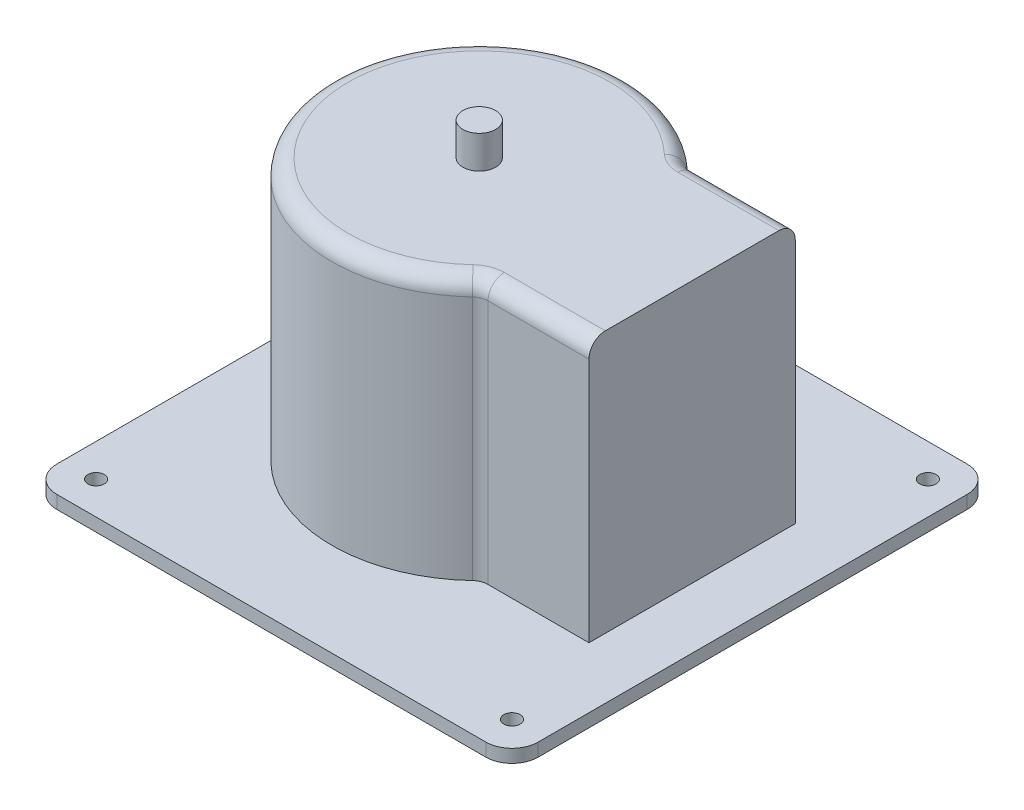
ISO-10303-21;
HEADER;
FILE_DESCRIPTION(('STEP AP214'),'2;1');
FILE_NAME('part.step','',(''),(''),'','','');
FILE_SCHEMA(('AUTOMOTIVE_DESIGN { 1 0 10303 214 1 1 1 1 }'));
ENDSEC;
DATA;
#1=APPLICATION_CONTEXT('core data for automotive mechanical design processes');
#2=APPLICATION_PROTOCOL_DEFINITION('international standard','automotive_design',2000,#1);
#3=PRODUCT_CONTEXT('',#1,'mechanical');
#4=PRODUCT('Part','Part','',(#3));
#5=PRODUCT_RELATED_PRODUCT_CATEGORY('part','',(#4));
#6=PRODUCT_DEFINITION_FORMATION('','',#4);
#7=PRODUCT_DEFINITION_CONTEXT('part definition',#1,'design');
#8=PRODUCT_DEFINITION('design','',#6,#7);
#9=PRODUCT_DEFINITION_SHAPE('','',#8);
#10=(LENGTH_UNIT() NAMED_UNIT(*) SI_UNIT(.MILLI.,.METRE.));
#11=(NAMED_UNIT(*) PLANE_ANGLE_UNIT() SI_UNIT($,.RADIAN.));
#12=(NAMED_UNIT(*) SI_UNIT($,.STERADIAN.) SOLID_ANGLE_UNIT());
#13=UNCERTAINTY_MEASURE_WITH_UNIT(LENGTH_MEASURE(1.E-05),#10,'distance_accuracy_value','');
#14=(GEOMETRIC_REPRESENTATION_CONTEXT(3) GLOBAL_UNCERTAINTY_ASSIGNED_CONTEXT((#13)) GLOBAL_UNIT_ASSIGNED_CONTEXT((#10,
#11,#12)) REPRESENTATION_CONTEXT('',''));
#15=CARTESIAN_POINT('',(0.,0.,0.));
#16=DIRECTION('',(0.,0.,1.));
#17=DIRECTION('',(1.,0.,0.));
#18=AXIS2_PLACEMENT_3D('',#15,#16,#17);
#19=CARTESIAN_POINT('',(0.,80.,0.));
#20=DIRECTION('',(0.,-1.,0.));
#21=DIRECTION('',(0.,0.,-1.));
#22=AXIS2_PLACEMENT_3D('',#19,#20,#21);
#23=CYLINDRICAL_SURFACE('',#22,45.);
#24=CARTESIAN_POINT('',(0.,0.,0.));
#25=DIRECTION('',(0.,1.,0.));
#26=DIRECTION('',(0.,0.,1.));
#27=AXIS2_PLACEMENT_3D('',#24,#25,#26);
#28=CIRCLE('',#27,45.);
#29=CARTESIAN_POINT('',(30.7551215247152,0.,-32.85));
#30=VERTEX_POINT('',#29);
#31=CARTESIAN_POINT('',(30.7551215247152,0.,32.85));
#32=VERTEX_POINT('',#31);
#33=EDGE_CURVE('E172',#30,#32,#28,.T.);
#34=ORIENTED_EDGE('',*,*,#33,.T.);
#35=DIRECTION('',(0.,-1.,0.));
#36=VECTOR('',#35,1.);
#37=CARTESIAN_POINT('',(30.7551215247152,80.,32.85));
#38=LINE('',#37,#36);
#39=CARTESIAN_POINT('',(30.7551215247152,75.,32.85));
#40=VERTEX_POINT('',#39);
#41=EDGE_CURVE('E157',#32,#40,#38,.F.);
#42=ORIENTED_EDGE('',*,*,#41,.T.);
#43=CARTESIAN_POINT('',(0.,75.,0.));
#44=DIRECTION('',(0.,1.,0.));
#45=DIRECTION('',(0.,0.,1.));
#46=AXIS2_PLACEMENT_3D('',#43,#44,#45);
#47=CIRCLE('',#46,45.);
#48=CARTESIAN_POINT('',(30.7551215247152,75.,-32.85));
#49=VERTEX_POINT('',#48);
#50=EDGE_CURVE('E169',#40,#49,#47,.F.);
#51=ORIENTED_EDGE('',*,*,#50,.T.);
#52=DIRECTION('',(0.,-1.,0.));
#53=VECTOR('',#52,1.);
#54=CARTESIAN_POINT('',(30.7551215247152,80.,-32.85));
#55=LINE('',#54,#53);
#56=EDGE_CURVE('E174',#49,#30,#55,.T.);
#57=ORIENTED_EDGE('',*,*,#56,.T.);
#58=EDGE_LOOP('',(#34,#42,#51,#57));
#59=FACE_BOUND('',#58,.T.);
#60=ADVANCED_FACE('F37',(#59),#23,.T.);
#61=CARTESIAN_POINT('',(0.,80.,0.));
#62=DIRECTION('',(0.,1.,0.));
#63=DIRECTION('',(0.,0.,1.));
#64=AXIS2_PLACEMENT_3D('',#61,#62,#63);
#65=PLANE('',#64);
#66=CARTESIAN_POINT('',(0.,80.,0.));
#67=DIRECTION('',(0.,1.,0.));
#68=DIRECTION('',(0.,0.,1.));
#69=AXIS2_PLACEMENT_3D('',#66,#67,#68);
#70=CIRCLE('',#69,5.);
#71=CARTESIAN_POINT('',(0.,80.,5.));
#72=VERTEX_POINT('',#71);
#73=EDGE_CURVE('E267',#72,#72,#70,.T.);
#74=ORIENTED_EDGE('',*,*,#73,.F.);
#75=EDGE_LOOP('',(#74));
#76=FACE_BOUND('',#75,.T.);
#77=DIRECTION('',(0.,0.,1.));
#78=VECTOR('',#77,1.);
#79=CARTESIAN_POINT('',(65.,80.,31.5));
#80=LINE('',#79,#78);
#81=CARTESIAN_POINT('',(65.,80.,-26.5));
#82=VERTEX_POINT('',#81);
#83=CARTESIAN_POINT('',(65.,80.,26.5));
#84=VERTEX_POINT('',#83);
#85=EDGE_CURVE('E271',#82,#84,#80,.T.);
#86=ORIENTED_EDGE('',*,*,#85,.F.);
#87=DIRECTION('',(1.,0.,0.));
#88=VECTOR('',#87,1.);
#89=CARTESIAN_POINT('',(0.,80.,-26.5));
#90=LINE('',#89,#88);
#91=CARTESIAN_POINT('',(34.1723572496835,80.,-26.5));
#92=VERTEX_POINT('',#91);
#93=EDGE_CURVE('E295',#82,#92,#90,.F.);
#94=ORIENTED_EDGE('',*,*,#93,.T.);
#95=CARTESIAN_POINT('',(34.1723572496835,80.,-36.5));
#96=DIRECTION('',(0.,1.,0.));
#97=DIRECTION('',(0.,0.,1.));
#98=AXIS2_PLACEMENT_3D('',#95,#96,#97);
#99=CIRCLE('',#98,10.);
#100=CARTESIAN_POINT('',(27.3378857997468,80.,-29.2));
#101=VERTEX_POINT('',#100);
#102=EDGE_CURVE('E292',#101,#92,#99,.T.);
#103=ORIENTED_EDGE('',*,*,#102,.F.);
#104=CARTESIAN_POINT('',(0.,80.,0.));
#105=DIRECTION('',(0.,1.,0.));
#106=DIRECTION('',(0.,0.,1.));
#107=AXIS2_PLACEMENT_3D('',#104,#105,#106);
#108=CIRCLE('',#107,40.);
#109=CARTESIAN_POINT('',(27.3378857997468,80.,29.2));
#110=VERTEX_POINT('',#109);
#111=EDGE_CURVE('E289',#101,#110,#108,.T.);
#112=ORIENTED_EDGE('',*,*,#111,.T.);
#113=CARTESIAN_POINT('',(34.1723572496835,80.,36.5));
#114=DIRECTION('',(0.,1.,0.));
#115=DIRECTION('',(0.,0.,1.));
#116=AXIS2_PLACEMENT_3D('',#113,#114,#115);
#117=CIRCLE('',#116,10.);
#118=CARTESIAN_POINT('',(34.1723572496835,80.,26.5));
#119=VERTEX_POINT('',#118);
#120=EDGE_CURVE('E286',#119,#110,#117,.T.);
#121=ORIENTED_EDGE('',*,*,#120,.F.);
#122=DIRECTION('',(1.,0.,0.));
#123=VECTOR('',#122,1.);
#124=CARTESIAN_POINT('',(0.,80.,26.5));
#125=LINE('',#124,#123);
#126=EDGE_CURVE('E178',#119,#84,#125,.T.);
#127=ORIENTED_EDGE('',*,*,#126,.T.);
#128=EDGE_LOOP('',(#86,#94,#103,#112,#121,#127));
#129=FACE_BOUND('',#128,.T.);
#130=ADVANCED_FACE('F339',(#76,#129),#65,.T.);
#131=CARTESIAN_POINT('',(65.,0.,0.));
#132=DIRECTION('',(1.,0.,0.));
#133=DIRECTION('',(0.,0.,-1.));
#134=AXIS2_PLACEMENT_3D('',#131,#132,#133);
#135=PLANE('',#134);
#136=DIRECTION('',(0.,1.,0.));
#137=VECTOR('',#136,1.);
#138=CARTESIAN_POINT('',(65.,80.,-31.5));
#139=LINE('',#138,#137);
#140=CARTESIAN_POINT('',(65.,0.,-31.5));
#141=VERTEX_POINT('',#140);
#142=CARTESIAN_POINT('',(65.,75.,-31.5));
#143=VERTEX_POINT('',#142);
#144=EDGE_CURVE('E275',#141,#143,#139,.T.);
#145=ORIENTED_EDGE('',*,*,#144,.T.);
#146=CARTESIAN_POINT('',(65.,75.,-26.5));
#147=DIRECTION('',(1.,0.,0.));
#148=DIRECTION('',(0.,0.,-1.));
#149=AXIS2_PLACEMENT_3D('',#146,#147,#148);
#150=CIRCLE('',#149,5.);
#151=EDGE_CURVE('E186',#143,#82,#150,.T.);
#152=ORIENTED_EDGE('',*,*,#151,.T.);
#153=ORIENTED_EDGE('',*,*,#85,.T.);
#154=CARTESIAN_POINT('',(65.,75.,26.5));
#155=DIRECTION('',(1.,0.,0.));
#156=DIRECTION('',(0.,0.,-1.));
#157=AXIS2_PLACEMENT_3D('',#154,#155,#156);
#158=CIRCLE('',#157,5.);
#159=CARTESIAN_POINT('',(65.,75.,31.5));
#160=VERTEX_POINT('',#159);
#161=EDGE_CURVE('E190',#84,#160,#158,.T.);
#162=ORIENTED_EDGE('',*,*,#161,.T.);
#163=DIRECTION('',(0.,-1.,0.));
#164=VECTOR('',#163,1.);
#165=CARTESIAN_POINT('',(65.,80.,31.5));
#166=LINE('',#165,#164);
#167=CARTESIAN_POINT('',(65.,0.,31.5));
#168=VERTEX_POINT('',#167);
#169=EDGE_CURVE('E210',#160,#168,#166,.T.);
#170=ORIENTED_EDGE('',*,*,#169,.T.);
#171=DIRECTION('',(0.,0.,-1.));
#172=VECTOR('',#171,1.);
#173=CARTESIAN_POINT('',(65.,0.,31.5));
#174=LINE('',#173,#172);
#175=EDGE_CURVE('E278',#168,#141,#174,.T.);
#176=ORIENTED_EDGE('',*,*,#175,.T.);
#177=EDGE_LOOP('',(#145,#152,#153,#162,#170,#176));
#178=FACE_BOUND('',#177,.T.);
#179=ADVANCED_FACE('F308',(#178),#135,.T.);
#180=CARTESIAN_POINT('',(-45.001,80.,-31.5));
#181=DIRECTION('',(0.,0.,-1.));
#182=DIRECTION('',(0.,1.,0.));
#183=AXIS2_PLACEMENT_3D('',#180,#181,#182);
#184=PLANE('',#183);
#185=DIRECTION('',(1.,0.,0.));
#186=VECTOR('',#185,1.);
#187=CARTESIAN_POINT('',(-45.001,0.,-31.5));
#188=LINE('',#187,#186);
#189=CARTESIAN_POINT('',(34.1723572496835,0.,-31.5));
#190=VERTEX_POINT('',#189);
#191=EDGE_CURVE('E274',#190,#141,#188,.T.);
#192=ORIENTED_EDGE('',*,*,#191,.F.);
#193=DIRECTION('',(0.,-1.,0.));
#194=VECTOR('',#193,1.);
#195=CARTESIAN_POINT('',(34.1723572496835,80.,-31.5));
#196=LINE('',#195,#194);
#197=CARTESIAN_POINT('',(34.1723572496835,75.,-31.5));
#198=VERTEX_POINT('',#197);
#199=EDGE_CURVE('E304',#190,#198,#196,.F.);
#200=ORIENTED_EDGE('',*,*,#199,.T.);
#201=DIRECTION('',(1.,0.,0.));
#202=VECTOR('',#201,1.);
#203=CARTESIAN_POINT('',(-45.001,75.,-31.5));
#204=LINE('',#203,#202);
#205=EDGE_CURVE('E302',#198,#143,#204,.T.);
#206=ORIENTED_EDGE('',*,*,#205,.T.);
#207=ORIENTED_EDGE('',*,*,#144,.F.);
#208=EDGE_LOOP('',(#192,#200,#206,#207));
#209=FACE_BOUND('',#208,.T.);
#210=ADVANCED_FACE('F337',(#209),#184,.T.);
#211=CARTESIAN_POINT('',(-45.001,80.,31.5));
#212=DIRECTION('',(0.,0.,1.));
#213=DIRECTION('',(0.,-1.,0.));
#214=AXIS2_PLACEMENT_3D('',#211,#212,#213);
#215=PLANE('',#214);
#216=DIRECTION('',(1.,0.,0.));
#217=VECTOR('',#216,1.);
#218=CARTESIAN_POINT('',(-45.001,75.,31.5));
#219=LINE('',#218,#217);
#220=CARTESIAN_POINT('',(34.1723572496835,75.,31.5));
#221=VERTEX_POINT('',#220);
#222=EDGE_CURVE('E168',#160,#221,#219,.F.);
#223=ORIENTED_EDGE('',*,*,#222,.T.);
#224=DIRECTION('',(0.,-1.,0.));
#225=VECTOR('',#224,1.);
#226=CARTESIAN_POINT('',(34.1723572496835,80.,31.5));
#227=LINE('',#226,#225);
#228=CARTESIAN_POINT('',(34.1723572496835,0.,31.5));
#229=VERTEX_POINT('',#228);
#230=EDGE_CURVE('E300',#221,#229,#227,.T.);
#231=ORIENTED_EDGE('',*,*,#230,.T.);
#232=DIRECTION('',(1.,0.,0.));
#233=VECTOR('',#232,1.);
#234=CARTESIAN_POINT('',(-45.001,0.,31.5));
#235=LINE('',#234,#233);
#236=EDGE_CURVE('E179',#229,#168,#235,.T.);
#237=ORIENTED_EDGE('',*,*,#236,.T.);
#238=ORIENTED_EDGE('',*,*,#169,.F.);
#239=EDGE_LOOP('',(#223,#231,#237,#238));
#240=FACE_BOUND('',#239,.T.);
#241=ADVANCED_FACE('F314',(#240),#215,.T.);
#242=CARTESIAN_POINT('',(34.1723572496835,80.,-36.5));
#243=DIRECTION('',(0.,-1.,0.));
#244=DIRECTION('',(0.,0.,-1.));
#245=AXIS2_PLACEMENT_3D('',#242,#243,#244);
#246=CYLINDRICAL_SURFACE('',#245,5.);
#247=CARTESIAN_POINT('',(34.1723572496835,0.,-36.5));
#248=DIRECTION('',(0.,1.,0.));
#249=DIRECTION('',(0.,0.,1.));
#250=AXIS2_PLACEMENT_3D('',#247,#248,#249);
#251=CIRCLE('',#250,5.);
#252=EDGE_CURVE('E185',#30,#190,#251,.T.);
#253=ORIENTED_EDGE('',*,*,#252,.F.);
#254=ORIENTED_EDGE('',*,*,#56,.F.);
#255=CARTESIAN_POINT('',(34.1723572496835,75.,-36.5));
#256=DIRECTION('',(0.,1.,0.));
#257=DIRECTION('',(0.,0.,1.));
#258=AXIS2_PLACEMENT_3D('',#255,#256,#257);
#259=CIRCLE('',#258,5.);
#260=EDGE_CURVE('E207',#198,#49,#259,.F.);
#261=ORIENTED_EDGE('',*,*,#260,.F.);
#262=ORIENTED_EDGE('',*,*,#199,.F.);
#263=EDGE_LOOP('',(#253,#254,#261,#262));
#264=FACE_BOUND('',#263,.T.);
#265=ADVANCED_FACE('F326',(#264),#246,.F.);
#266=CARTESIAN_POINT('',(-45.001,75.,-26.5));
#267=DIRECTION('',(1.,0.,0.));
#268=DIRECTION('',(0.,0.,-1.));
#269=AXIS2_PLACEMENT_3D('',#266,#267,#268);
#270=CYLINDRICAL_SURFACE('',#269,5.);
#271=ORIENTED_EDGE('',*,*,#151,.F.);
#272=ORIENTED_EDGE('',*,*,#205,.F.);
#273=CARTESIAN_POINT('',(34.1723572496835,75.,-26.5));
#274=DIRECTION('',(-1.,0.,0.));
#275=DIRECTION('',(0.,0.,1.));
#276=AXIS2_PLACEMENT_3D('',#273,#274,#275);
#277=CIRCLE('',#276,5.);
#278=EDGE_CURVE('E204',#92,#198,#277,.T.);
#279=ORIENTED_EDGE('',*,*,#278,.F.);
#280=ORIENTED_EDGE('',*,*,#93,.F.);
#281=EDGE_LOOP('',(#271,#272,#279,#280));
#282=FACE_BOUND('',#281,.T.);
#283=ADVANCED_FACE('F335',(#282),#270,.T.);
#284=CARTESIAN_POINT('',(0.,75.,26.5));
#285=DIRECTION('',(1.,0.,0.));
#286=DIRECTION('',(0.,0.,-1.));
#287=AXIS2_PLACEMENT_3D('',#284,#285,#286);
#288=CYLINDRICAL_SURFACE('',#287,5.);
#289=ORIENTED_EDGE('',*,*,#161,.F.);
#290=ORIENTED_EDGE('',*,*,#126,.F.);
#291=CARTESIAN_POINT('',(34.1723572496835,75.,26.5));
#292=DIRECTION('',(-1.,0.,0.));
#293=DIRECTION('',(0.,0.,1.));
#294=AXIS2_PLACEMENT_3D('',#291,#292,#293);
#295=CIRCLE('',#294,5.);
#296=EDGE_CURVE('E201',#221,#119,#295,.T.);
#297=ORIENTED_EDGE('',*,*,#296,.F.);
#298=ORIENTED_EDGE('',*,*,#222,.F.);
#299=EDGE_LOOP('',(#289,#290,#297,#298));
#300=FACE_BOUND('',#299,.T.);
#301=ADVANCED_FACE('F316',(#300),#288,.T.);
#302=CARTESIAN_POINT('',(34.1723572496835,80.,36.5));
#303=DIRECTION('',(0.,-1.,0.));
#304=DIRECTION('',(0.,0.,-1.));
#305=AXIS2_PLACEMENT_3D('',#302,#303,#304);
#306=CYLINDRICAL_SURFACE('',#305,5.);
#307=CARTESIAN_POINT('',(34.1723572496835,0.,36.5));
#308=DIRECTION('',(0.,1.,0.));
#309=DIRECTION('',(0.,0.,1.));
#310=AXIS2_PLACEMENT_3D('',#307,#308,#309);
#311=CIRCLE('',#310,5.);
#312=EDGE_CURVE('E162',#229,#32,#311,.T.);
#313=ORIENTED_EDGE('',*,*,#312,.F.);
#314=ORIENTED_EDGE('',*,*,#230,.F.);
#315=CARTESIAN_POINT('',(34.1723572496835,75.,36.5));
#316=DIRECTION('',(0.,1.,0.));
#317=DIRECTION('',(0.,0.,1.));
#318=AXIS2_PLACEMENT_3D('',#315,#316,#317);
#319=CIRCLE('',#318,5.);
#320=EDGE_CURVE('E165',#40,#221,#319,.F.);
#321=ORIENTED_EDGE('',*,*,#320,.F.);
#322=ORIENTED_EDGE('',*,*,#41,.F.);
#323=EDGE_LOOP('',(#313,#314,#321,#322));
#324=FACE_BOUND('',#323,.T.);
#325=ADVANCED_FACE('F159',(#324),#306,.F.);
#326=CARTESIAN_POINT('',(34.1723572496835,75.,-36.5));
#327=DIRECTION('',(0.,1.,0.));
#328=DIRECTION('',(0.,0.,1.));
#329=AXIS2_PLACEMENT_3D('',#326,#327,#328);
#330=TOROIDAL_SURFACE('',#329,10.,5.);
#331=ORIENTED_EDGE('',*,*,#278,.T.);
#332=ORIENTED_EDGE('',*,*,#260,.T.);
#333=CARTESIAN_POINT('',(27.3378857997468,75.,-29.2));
#334=DIRECTION('',(0.73,0.,0.683447144993671));
#335=DIRECTION('',(0.683447144993671,0.,-0.73));
#336=AXIS2_PLACEMENT_3D('',#333,#334,#335);
#337=CIRCLE('',#336,5.);
#338=EDGE_CURVE('E196',#101,#49,#337,.F.);
#339=ORIENTED_EDGE('',*,*,#338,.F.);
#340=ORIENTED_EDGE('',*,*,#102,.T.);
#341=EDGE_LOOP('',(#331,#332,#339,#340));
#342=FACE_BOUND('',#341,.T.);
#343=ADVANCED_FACE('F329',(#342),#330,.T.);
#344=CARTESIAN_POINT('',(34.1723572496835,75.,36.5));
#345=DIRECTION('',(0.,1.,0.));
#346=DIRECTION('',(0.,0.,1.));
#347=AXIS2_PLACEMENT_3D('',#344,#345,#346);
#348=TOROIDAL_SURFACE('',#347,10.,5.);
#349=ORIENTED_EDGE('',*,*,#296,.T.);
#350=ORIENTED_EDGE('',*,*,#120,.T.);
#351=CARTESIAN_POINT('',(27.3378857997468,75.,29.2));
#352=DIRECTION('',(0.73,0.,-0.683447144993671));
#353=DIRECTION('',(-0.683447144993671,0.,-0.73));
#354=AXIS2_PLACEMENT_3D('',#351,#352,#353);
#355=CIRCLE('',#354,5.);
#356=EDGE_CURVE('E194',#40,#110,#355,.F.);
#357=ORIENTED_EDGE('',*,*,#356,.F.);
#358=ORIENTED_EDGE('',*,*,#320,.T.);
#359=EDGE_LOOP('',(#349,#350,#357,#358));
#360=FACE_BOUND('',#359,.T.);
#361=ADVANCED_FACE('F319',(#360),#348,.T.);
#362=CARTESIAN_POINT('',(0.,75.,0.));
#363=DIRECTION('',(0.,1.,0.));
#364=DIRECTION('',(0.,0.,1.));
#365=AXIS2_PLACEMENT_3D('',#362,#363,#364);
#366=TOROIDAL_SURFACE('',#365,40.,5.);
#367=ORIENTED_EDGE('',*,*,#338,.T.);
#368=ORIENTED_EDGE('',*,*,#50,.F.);
#369=ORIENTED_EDGE('',*,*,#356,.T.);
#370=ORIENTED_EDGE('',*,*,#111,.F.);
#371=EDGE_LOOP('',(#367,#368,#369,#370));
#372=FACE_BOUND('',#371,.T.);
#373=ADVANCED_FACE('F322',(#372),#366,.T.);
#374=CARTESIAN_POINT('',(0.,90.,0.));
#375=DIRECTION('',(0.,-1.,0.));
#376=DIRECTION('',(0.,0.,-1.));
#377=AXIS2_PLACEMENT_3D('',#374,#375,#376);
#378=CYLINDRICAL_SURFACE('',#377,5.);
#379=CARTESIAN_POINT('',(0.,90.,0.));
#380=DIRECTION('',(0.,1.,0.));
#381=DIRECTION('',(0.,0.,1.));
#382=AXIS2_PLACEMENT_3D('',#379,#380,#381);
#383=CIRCLE('',#382,5.);
#384=CARTESIAN_POINT('',(0.,90.,5.));
#385=VERTEX_POINT('',#384);
#386=EDGE_CURVE('E197',#385,#385,#383,.T.);
#387=ORIENTED_EDGE('',*,*,#386,.F.);
#388=EDGE_LOOP('',(#387));
#389=FACE_BOUND('',#388,.T.);
#390=ORIENTED_EDGE('',*,*,#73,.T.);
#391=EDGE_LOOP('',(#390));
#392=FACE_BOUND('',#391,.T.);
#393=ADVANCED_FACE('F357',(#389,#392),#378,.T.);
#394=CARTESIAN_POINT('',(0.,90.,0.));
#395=DIRECTION('',(0.,1.,0.));
#396=DIRECTION('',(0.,0.,1.));
#397=AXIS2_PLACEMENT_3D('',#394,#395,#396);
#398=PLANE('',#397);
#399=ORIENTED_EDGE('',*,*,#386,.T.);
#400=EDGE_LOOP('',(#399));
#401=FACE_BOUND('',#400,.T.);
#402=ADVANCED_FACE('F460',(#401),#398,.T.);
#403=CARTESIAN_POINT('',(-63.5,-4.,73.5));
#404=DIRECTION('',(1.,0.,0.));
#405=DIRECTION('',(0.,0.,-1.));
#406=AXIS2_PLACEMENT_3D('',#403,#404,#405);
#407=PLANE('',#406);
#408=DIRECTION('',(0.,0.,-1.));
#409=VECTOR('',#408,1.);
#410=CARTESIAN_POINT('',(-63.5,-4.,73.5));
#411=LINE('',#410,#409);
#412=CARTESIAN_POINT('',(-63.5,-4.,65.5));
#413=VERTEX_POINT('',#412);
#414=CARTESIAN_POINT('',(-63.5,-4.,-65.5));
#415=VERTEX_POINT('',#414);
#416=EDGE_CURVE('E264',#413,#415,#411,.T.);
#417=ORIENTED_EDGE('',*,*,#416,.F.);
#418=DIRECTION('',(0.,1.,0.));
#419=VECTOR('',#418,1.);
#420=CARTESIAN_POINT('',(-63.5,-4.,65.5));
#421=LINE('',#420,#419);
#422=CARTESIAN_POINT('',(-63.5,0.,65.5));
#423=VERTEX_POINT('',#422);
#424=EDGE_CURVE('E212',#413,#423,#421,.T.);
#425=ORIENTED_EDGE('',*,*,#424,.T.);
#426=DIRECTION('',(0.,0.,-1.));
#427=VECTOR('',#426,1.);
#428=CARTESIAN_POINT('',(-63.5,0.,73.5));
#429=LINE('',#428,#427);
#430=CARTESIAN_POINT('',(-63.5,0.,-65.5));
#431=VERTEX_POINT('',#430);
#432=EDGE_CURVE('E254',#423,#431,#429,.T.);
#433=ORIENTED_EDGE('',*,*,#432,.T.);
#434=DIRECTION('',(0.,1.,0.));
#435=VECTOR('',#434,1.);
#436=CARTESIAN_POINT('',(-63.5,-4.,-65.5));
#437=LINE('',#436,#435);
#438=EDGE_CURVE('E188',#431,#415,#437,.F.);
#439=ORIENTED_EDGE('',*,*,#438,.T.);
#440=EDGE_LOOP('',(#417,#425,#433,#439));
#441=FACE_BOUND('',#440,.T.);
#442=ADVANCED_FACE('F457',(#441),#407,.F.);
#443=CARTESIAN_POINT('',(-63.5,-4.,-73.5));
#444=DIRECTION('',(0.,0.,1.));
#445=DIRECTION('',(1.,0.,0.));
#446=AXIS2_PLACEMENT_3D('',#443,#444,#445);
#447=PLANE('',#446);
#448=DIRECTION('',(1.,0.,0.));
#449=VECTOR('',#448,1.);
#450=CARTESIAN_POINT('',(-63.5,0.,-73.5));
#451=LINE('',#450,#449);
#452=CARTESIAN_POINT('',(-55.5,0.,-73.5));
#453=VERTEX_POINT('',#452);
#454=CARTESIAN_POINT('',(75.5,0.,-73.5));
#455=VERTEX_POINT('',#454);
#456=EDGE_CURVE('E245',#453,#455,#451,.T.);
#457=ORIENTED_EDGE('',*,*,#456,.T.);
#458=DIRECTION('',(0.,1.,0.));
#459=VECTOR('',#458,1.);
#460=CARTESIAN_POINT('',(75.5,-4.,-73.5));
#461=LINE('',#460,#459);
#462=CARTESIAN_POINT('',(75.5,-4.,-73.5));
#463=VERTEX_POINT('',#462);
#464=EDGE_CURVE('E11',#455,#463,#461,.F.);
#465=ORIENTED_EDGE('',*,*,#464,.T.);
#466=DIRECTION('',(1.,0.,0.));
#467=VECTOR('',#466,1.);
#468=CARTESIAN_POINT('',(-63.5,-4.,-73.5));
#469=LINE('',#468,#467);
#470=CARTESIAN_POINT('',(-55.5,-4.,-73.5));
#471=VERTEX_POINT('',#470);
#472=EDGE_CURVE('E247',#471,#463,#469,.T.);
#473=ORIENTED_EDGE('',*,*,#472,.F.);
#474=DIRECTION('',(0.,1.,0.));
#475=VECTOR('',#474,1.);
#476=CARTESIAN_POINT('',(-55.5,-4.,-73.5));
#477=LINE('',#476,#475);
#478=EDGE_CURVE('E45',#471,#453,#477,.T.);
#479=ORIENTED_EDGE('',*,*,#478,.T.);
#480=EDGE_LOOP('',(#457,#465,#473,#479));
#481=FACE_BOUND('',#480,.T.);
#482=ADVANCED_FACE('F244',(#481),#447,.F.);
#483=CARTESIAN_POINT('',(83.5,-4.,73.5));
#484=DIRECTION('',(-1.,0.,0.));
#485=DIRECTION('',(0.,0.,1.));
#486=AXIS2_PLACEMENT_3D('',#483,#484,#485);
#487=PLANE('',#486);
#488=DIRECTION('',(0.,0.,1.));
#489=VECTOR('',#488,1.);
#490=CARTESIAN_POINT('',(83.5,0.,73.5));
#491=LINE('',#490,#489);
#492=CARTESIAN_POINT('',(83.5,0.,-65.5));
#493=VERTEX_POINT('',#492);
#494=CARTESIAN_POINT('',(83.5,0.,65.5));
#495=VERTEX_POINT('',#494);
#496=EDGE_CURVE('E253',#493,#495,#491,.T.);
#497=ORIENTED_EDGE('',*,*,#496,.T.);
#498=DIRECTION('',(0.,1.,0.));
#499=VECTOR('',#498,1.);
#500=CARTESIAN_POINT('',(83.5,-4.,65.5));
#501=LINE('',#500,#499);
#502=CARTESIAN_POINT('',(83.5,-4.,65.5));
#503=VERTEX_POINT('',#502);
#504=EDGE_CURVE('E52',#495,#503,#501,.F.);
#505=ORIENTED_EDGE('',*,*,#504,.T.);
#506=DIRECTION('',(0.,0.,1.));
#507=VECTOR('',#506,1.);
#508=CARTESIAN_POINT('',(83.5,-4.,73.5));
#509=LINE('',#508,#507);
#510=CARTESIAN_POINT('',(83.5,-4.,-65.5));
#511=VERTEX_POINT('',#510);
#512=EDGE_CURVE('E386',#511,#503,#509,.T.);
#513=ORIENTED_EDGE('',*,*,#512,.F.);
#514=DIRECTION('',(0.,1.,0.));
#515=VECTOR('',#514,1.);
#516=CARTESIAN_POINT('',(83.5,-4.,-65.5));
#517=LINE('',#516,#515);
#518=EDGE_CURVE('E235',#511,#493,#517,.T.);
#519=ORIENTED_EDGE('',*,*,#518,.T.);
#520=EDGE_LOOP('',(#497,#505,#513,#519));
#521=FACE_BOUND('',#520,.T.);
#522=ADVANCED_FACE('F385',(#521),#487,.F.);
#523=CARTESIAN_POINT('',(-63.5,-4.,73.5));
#524=DIRECTION('',(0.,0.,-1.));
#525=DIRECTION('',(-1.,0.,0.));
#526=AXIS2_PLACEMENT_3D('',#523,#524,#525);
#527=PLANE('',#526);
#528=DIRECTION('',(-1.,0.,0.));
#529=VECTOR('',#528,1.);
#530=CARTESIAN_POINT('',(-63.5,0.,73.5));
#531=LINE('',#530,#529);
#532=CARTESIAN_POINT('',(75.5,0.,73.5));
#533=VERTEX_POINT('',#532);
#534=CARTESIAN_POINT('',(-55.5,0.,73.5));
#535=VERTEX_POINT('',#534);
#536=EDGE_CURVE('E256',#533,#535,#531,.T.);
#537=ORIENTED_EDGE('',*,*,#536,.T.);
#538=DIRECTION('',(0.,1.,0.));
#539=VECTOR('',#538,1.);
#540=CARTESIAN_POINT('',(-55.5,-4.,73.5));
#541=LINE('',#540,#539);
#542=CARTESIAN_POINT('',(-55.5,-4.,73.5));
#543=VERTEX_POINT('',#542);
#544=EDGE_CURVE('E226',#535,#543,#541,.F.);
#545=ORIENTED_EDGE('',*,*,#544,.T.);
#546=DIRECTION('',(-1.,0.,0.));
#547=VECTOR('',#546,1.);
#548=CARTESIAN_POINT('',(-63.5,-4.,73.5));
#549=LINE('',#548,#547);
#550=CARTESIAN_POINT('',(75.5,-4.,73.5));
#551=VERTEX_POINT('',#550);
#552=EDGE_CURVE('E270',#551,#543,#549,.T.);
#553=ORIENTED_EDGE('',*,*,#552,.F.);
#554=DIRECTION('',(0.,1.,0.));
#555=VECTOR('',#554,1.);
#556=CARTESIAN_POINT('',(75.5,-4.,73.5));
#557=LINE('',#556,#555);
#558=EDGE_CURVE('E223',#551,#533,#557,.T.);
#559=ORIENTED_EDGE('',*,*,#558,.T.);
#560=EDGE_LOOP('',(#537,#545,#553,#559));
#561=FACE_BOUND('',#560,.T.);
#562=ADVANCED_FACE('F392',(#561),#527,.F.);
#563=CARTESIAN_POINT('',(0.,-4.,0.));
#564=DIRECTION('',(0.,-1.,0.));
#565=DIRECTION('',(0.,0.,-1.));
#566=AXIS2_PLACEMENT_3D('',#563,#564,#565);
#567=PLANE('',#566);
#568=CARTESIAN_POINT('',(73.5,-4.,-63.5));
#569=DIRECTION('',(0.,1.,0.));
#570=DIRECTION('',(0.,0.,1.));
#571=AXIS2_PLACEMENT_3D('',#568,#569,#570);
#572=CIRCLE('',#571,2.50000000000001);
#573=CARTESIAN_POINT('',(73.5,-4.,-61.));
#574=VERTEX_POINT('',#573);
#575=EDGE_CURVE('E414',#574,#574,#572,.T.);
#576=ORIENTED_EDGE('',*,*,#575,.T.);
#577=EDGE_LOOP('',(#576));
#578=FACE_BOUND('',#577,.T.);
#579=CARTESIAN_POINT('',(-53.5,-4.,63.5));
#580=DIRECTION('',(0.,1.,0.));
#581=DIRECTION('',(0.,0.,1.));
#582=AXIS2_PLACEMENT_3D('',#579,#580,#581);
#583=CIRCLE('',#582,2.5);
#584=CARTESIAN_POINT('',(-53.5,-4.,66.));
#585=VERTEX_POINT('',#584);
#586=EDGE_CURVE('E407',#585,#585,#583,.T.);
#587=ORIENTED_EDGE('',*,*,#586,.T.);
#588=EDGE_LOOP('',(#587));
#589=FACE_BOUND('',#588,.T.);
#590=CARTESIAN_POINT('',(73.5,-4.,63.5));
#591=DIRECTION('',(0.,1.,0.));
#592=DIRECTION('',(0.,0.,1.));
#593=AXIS2_PLACEMENT_3D('',#590,#591,#592);
#594=CIRCLE('',#593,2.50000000000001);
#595=CARTESIAN_POINT('',(73.5,-4.,66.));
#596=VERTEX_POINT('',#595);
#597=EDGE_CURVE('E419',#596,#596,#594,.T.);
#598=ORIENTED_EDGE('',*,*,#597,.T.);
#599=EDGE_LOOP('',(#598));
#600=FACE_BOUND('',#599,.T.);
#601=CARTESIAN_POINT('',(-53.5,-4.,-63.5));
#602=DIRECTION('',(0.,1.,0.));
#603=DIRECTION('',(0.,0.,1.));
#604=AXIS2_PLACEMENT_3D('',#601,#602,#603);
#605=CIRCLE('',#604,2.5);
#606=CARTESIAN_POINT('',(-53.5,-4.,-61.));
#607=VERTEX_POINT('',#606);
#608=EDGE_CURVE('E258',#607,#607,#605,.T.);
#609=ORIENTED_EDGE('',*,*,#608,.T.);
#610=EDGE_LOOP('',(#609));
#611=FACE_BOUND('',#610,.T.);
#612=ORIENTED_EDGE('',*,*,#552,.T.);
#613=CARTESIAN_POINT('',(-55.5,-4.,65.5));
#614=DIRECTION('',(0.,-1.,0.));
#615=DIRECTION('',(0.,0.,-1.));
#616=AXIS2_PLACEMENT_3D('',#613,#614,#615);
#617=CIRCLE('',#616,8.);
#618=EDGE_CURVE('E233',#543,#413,#617,.T.);
#619=ORIENTED_EDGE('',*,*,#618,.T.);
#620=ORIENTED_EDGE('',*,*,#416,.T.);
#621=CARTESIAN_POINT('',(-55.5,-4.,-65.5));
#622=DIRECTION('',(0.,-1.,0.));
#623=DIRECTION('',(0.,0.,-1.));
#624=AXIS2_PLACEMENT_3D('',#621,#622,#623);
#625=CIRCLE('',#624,8.);
#626=EDGE_CURVE('E228',#415,#471,#625,.T.);
#627=ORIENTED_EDGE('',*,*,#626,.T.);
#628=ORIENTED_EDGE('',*,*,#472,.T.);
#629=CARTESIAN_POINT('',(75.5,-4.,-65.5));
#630=DIRECTION('',(0.,-1.,0.));
#631=DIRECTION('',(0.,0.,-1.));
#632=AXIS2_PLACEMENT_3D('',#629,#630,#631);
#633=CIRCLE('',#632,8.);
#634=EDGE_CURVE('E59',#463,#511,#633,.T.);
#635=ORIENTED_EDGE('',*,*,#634,.T.);
#636=ORIENTED_EDGE('',*,*,#512,.T.);
#637=CARTESIAN_POINT('',(75.5,-4.,65.5));
#638=DIRECTION('',(0.,-1.,0.));
#639=DIRECTION('',(0.,0.,-1.));
#640=AXIS2_PLACEMENT_3D('',#637,#638,#639);
#641=CIRCLE('',#640,8.);
#642=EDGE_CURVE('E231',#503,#551,#641,.T.);
#643=ORIENTED_EDGE('',*,*,#642,.T.);
#644=EDGE_LOOP('',(#612,#619,#620,#627,#628,#635,#636,#643));
#645=FACE_BOUND('',#644,.T.);
#646=ADVANCED_FACE('F430',(#578,#589,#600,#611,#645),#567,.T.);
#647=CARTESIAN_POINT('',(0.,0.,0.));
#648=DIRECTION('',(0.,-1.,0.));
#649=DIRECTION('',(0.,0.,-1.));
#650=AXIS2_PLACEMENT_3D('',#647,#648,#649);
#651=PLANE('',#650);
#652=CARTESIAN_POINT('',(73.5,0.,-63.5));
#653=DIRECTION('',(0.,1.,0.));
#654=DIRECTION('',(0.,0.,1.));
#655=AXIS2_PLACEMENT_3D('',#652,#653,#654);
#656=CIRCLE('',#655,2.50000000000001);
#657=CARTESIAN_POINT('',(73.5,0.,-61.));
#658=VERTEX_POINT('',#657);
#659=EDGE_CURVE('E404',#658,#658,#656,.T.);
#660=ORIENTED_EDGE('',*,*,#659,.F.);
#661=EDGE_LOOP('',(#660));
#662=FACE_BOUND('',#661,.T.);
#663=CARTESIAN_POINT('',(-53.5,0.,63.5));
#664=DIRECTION('',(0.,1.,0.));
#665=DIRECTION('',(0.,0.,1.));
#666=AXIS2_PLACEMENT_3D('',#663,#664,#665);
#667=CIRCLE('',#666,2.5);
#668=CARTESIAN_POINT('',(-53.5,0.,66.));
#669=VERTEX_POINT('',#668);
#670=EDGE_CURVE('E410',#669,#669,#667,.T.);
#671=ORIENTED_EDGE('',*,*,#670,.F.);
#672=EDGE_LOOP('',(#671));
#673=FACE_BOUND('',#672,.T.);
#674=CARTESIAN_POINT('',(73.5,0.,63.5));
#675=DIRECTION('',(0.,1.,0.));
#676=DIRECTION('',(0.,0.,1.));
#677=AXIS2_PLACEMENT_3D('',#674,#675,#676);
#678=CIRCLE('',#677,2.50000000000001);
#679=CARTESIAN_POINT('',(73.5,0.,66.));
#680=VERTEX_POINT('',#679);
#681=EDGE_CURVE('E411',#680,#680,#678,.T.);
#682=ORIENTED_EDGE('',*,*,#681,.F.);
#683=EDGE_LOOP('',(#682));
#684=FACE_BOUND('',#683,.T.);
#685=CARTESIAN_POINT('',(-53.5,0.,-63.5));
#686=DIRECTION('',(0.,1.,0.));
#687=DIRECTION('',(0.,0.,1.));
#688=AXIS2_PLACEMENT_3D('',#685,#686,#687);
#689=CIRCLE('',#688,2.5);
#690=CARTESIAN_POINT('',(-53.5,0.,-61.));
#691=VERTEX_POINT('',#690);
#692=EDGE_CURVE('E401',#691,#691,#689,.T.);
#693=ORIENTED_EDGE('',*,*,#692,.F.);
#694=EDGE_LOOP('',(#693));
#695=FACE_BOUND('',#694,.T.);
#696=ORIENTED_EDGE('',*,*,#33,.F.);
#697=ORIENTED_EDGE('',*,*,#252,.T.);
#698=ORIENTED_EDGE('',*,*,#191,.T.);
#699=ORIENTED_EDGE('',*,*,#175,.F.);
#700=ORIENTED_EDGE('',*,*,#236,.F.);
#701=ORIENTED_EDGE('',*,*,#312,.T.);
#702=EDGE_LOOP('',(#696,#697,#698,#699,#700,#701));
#703=FACE_BOUND('',#702,.T.);
#704=ORIENTED_EDGE('',*,*,#432,.F.);
#705=CARTESIAN_POINT('',(-55.5,0.,65.5));
#706=DIRECTION('',(0.,-1.,0.));
#707=DIRECTION('',(0.,0.,-1.));
#708=AXIS2_PLACEMENT_3D('',#705,#706,#707);
#709=CIRCLE('',#708,8.);
#710=EDGE_CURVE('E221',#423,#535,#709,.F.);
#711=ORIENTED_EDGE('',*,*,#710,.T.);
#712=ORIENTED_EDGE('',*,*,#536,.F.);
#713=CARTESIAN_POINT('',(75.5,0.,65.5));
#714=DIRECTION('',(0.,-1.,0.));
#715=DIRECTION('',(0.,0.,-1.));
#716=AXIS2_PLACEMENT_3D('',#713,#714,#715);
#717=CIRCLE('',#716,8.);
#718=EDGE_CURVE('E219',#533,#495,#717,.F.);
#719=ORIENTED_EDGE('',*,*,#718,.T.);
#720=ORIENTED_EDGE('',*,*,#496,.F.);
#721=CARTESIAN_POINT('',(75.5,0.,-65.5));
#722=DIRECTION('',(0.,-1.,0.));
#723=DIRECTION('',(0.,0.,-1.));
#724=AXIS2_PLACEMENT_3D('',#721,#722,#723);
#725=CIRCLE('',#724,8.);
#726=EDGE_CURVE('E217',#493,#455,#725,.F.);
#727=ORIENTED_EDGE('',*,*,#726,.T.);
#728=ORIENTED_EDGE('',*,*,#456,.F.);
#729=CARTESIAN_POINT('',(-55.5,0.,-65.5));
#730=DIRECTION('',(0.,-1.,0.));
#731=DIRECTION('',(0.,0.,-1.));
#732=AXIS2_PLACEMENT_3D('',#729,#730,#731);
#733=CIRCLE('',#732,8.);
#734=EDGE_CURVE('E215',#453,#431,#733,.F.);
#735=ORIENTED_EDGE('',*,*,#734,.T.);
#736=EDGE_LOOP('',(#704,#711,#712,#719,#720,#727,#728,#735));
#737=FACE_BOUND('',#736,.T.);
#738=ADVANCED_FACE('F181',(#662,#673,#684,#695,#703,#737),#651,.F.);
#739=CARTESIAN_POINT('',(-53.5,-4.,-63.5));
#740=DIRECTION('',(0.,1.,0.));
#741=DIRECTION('',(0.,0.,1.));
#742=AXIS2_PLACEMENT_3D('',#739,#740,#741);
#743=CYLINDRICAL_SURFACE('',#742,2.5);
#744=ORIENTED_EDGE('',*,*,#608,.F.);
#745=EDGE_LOOP('',(#744));
#746=FACE_BOUND('',#745,.T.);
#747=ORIENTED_EDGE('',*,*,#692,.T.);
#748=EDGE_LOOP('',(#747));
#749=FACE_BOUND('',#748,.T.);
#750=ADVANCED_FACE('F429',(#746,#749),#743,.F.);
#751=CARTESIAN_POINT('',(73.5,-4.,63.5));
#752=DIRECTION('',(0.,1.,0.));
#753=DIRECTION('',(0.,0.,1.));
#754=AXIS2_PLACEMENT_3D('',#751,#752,#753);
#755=CYLINDRICAL_SURFACE('',#754,2.50000000000001);
#756=ORIENTED_EDGE('',*,*,#597,.F.);
#757=EDGE_LOOP('',(#756));
#758=FACE_BOUND('',#757,.T.);
#759=ORIENTED_EDGE('',*,*,#681,.T.);
#760=EDGE_LOOP('',(#759));
#761=FACE_BOUND('',#760,.T.);
#762=ADVANCED_FACE('F425',(#758,#761),#755,.F.);
#763=CARTESIAN_POINT('',(-53.5,-4.,63.5));
#764=DIRECTION('',(0.,1.,0.));
#765=DIRECTION('',(0.,0.,1.));
#766=AXIS2_PLACEMENT_3D('',#763,#764,#765);
#767=CYLINDRICAL_SURFACE('',#766,2.5);
#768=ORIENTED_EDGE('',*,*,#586,.F.);
#769=EDGE_LOOP('',(#768));
#770=FACE_BOUND('',#769,.T.);
#771=ORIENTED_EDGE('',*,*,#670,.T.);
#772=EDGE_LOOP('',(#771));
#773=FACE_BOUND('',#772,.T.);
#774=ADVANCED_FACE('F441',(#770,#773),#767,.F.);
#775=CARTESIAN_POINT('',(73.5,-4.,-63.5));
#776=DIRECTION('',(0.,1.,0.));
#777=DIRECTION('',(0.,0.,1.));
#778=AXIS2_PLACEMENT_3D('',#775,#776,#777);
#779=CYLINDRICAL_SURFACE('',#778,2.50000000000001);
#780=ORIENTED_EDGE('',*,*,#575,.F.);
#781=EDGE_LOOP('',(#780));
#782=FACE_BOUND('',#781,.T.);
#783=ORIENTED_EDGE('',*,*,#659,.T.);
#784=EDGE_LOOP('',(#783));
#785=FACE_BOUND('',#784,.T.);
#786=ADVANCED_FACE('F374',(#782,#785),#779,.F.);
#787=CARTESIAN_POINT('',(-55.5,-4.,65.5));
#788=DIRECTION('',(0.,1.,0.));
#789=DIRECTION('',(0.,0.,1.));
#790=AXIS2_PLACEMENT_3D('',#787,#788,#789);
#791=CYLINDRICAL_SURFACE('',#790,8.);
#792=ORIENTED_EDGE('',*,*,#618,.F.);
#793=ORIENTED_EDGE('',*,*,#544,.F.);
#794=ORIENTED_EDGE('',*,*,#710,.F.);
#795=ORIENTED_EDGE('',*,*,#424,.F.);
#796=EDGE_LOOP('',(#792,#793,#794,#795));
#797=FACE_BOUND('',#796,.T.);
#798=ADVANCED_FACE('F370',(#797),#791,.T.);
#799=CARTESIAN_POINT('',(75.5,-4.,65.5));
#800=DIRECTION('',(0.,1.,0.));
#801=DIRECTION('',(0.,0.,1.));
#802=AXIS2_PLACEMENT_3D('',#799,#800,#801);
#803=CYLINDRICAL_SURFACE('',#802,8.);
#804=ORIENTED_EDGE('',*,*,#642,.F.);
#805=ORIENTED_EDGE('',*,*,#504,.F.);
#806=ORIENTED_EDGE('',*,*,#718,.F.);
#807=ORIENTED_EDGE('',*,*,#558,.F.);
#808=EDGE_LOOP('',(#804,#805,#806,#807));
#809=FACE_BOUND('',#808,.T.);
#810=ADVANCED_FACE('F373',(#809),#803,.T.);
#811=CARTESIAN_POINT('',(75.5,-4.,-65.5));
#812=DIRECTION('',(0.,1.,0.));
#813=DIRECTION('',(0.,0.,1.));
#814=AXIS2_PLACEMENT_3D('',#811,#812,#813);
#815=CYLINDRICAL_SURFACE('',#814,8.);
#816=ORIENTED_EDGE('',*,*,#634,.F.);
#817=ORIENTED_EDGE('',*,*,#464,.F.);
#818=ORIENTED_EDGE('',*,*,#726,.F.);
#819=ORIENTED_EDGE('',*,*,#518,.F.);
#820=EDGE_LOOP('',(#816,#817,#818,#819));
#821=FACE_BOUND('',#820,.T.);
#822=ADVANCED_FACE('F377',(#821),#815,.T.);
#823=CARTESIAN_POINT('',(-55.5,-4.,-65.5));
#824=DIRECTION('',(0.,1.,0.));
#825=DIRECTION('',(0.,0.,1.));
#826=AXIS2_PLACEMENT_3D('',#823,#824,#825);
#827=CYLINDRICAL_SURFACE('',#826,8.);
#828=ORIENTED_EDGE('',*,*,#626,.F.);
#829=ORIENTED_EDGE('',*,*,#438,.F.);
#830=ORIENTED_EDGE('',*,*,#734,.F.);
#831=ORIENTED_EDGE('',*,*,#478,.F.);
#832=EDGE_LOOP('',(#828,#829,#830,#831));
#833=FACE_BOUND('',#832,.T.);
#834=ADVANCED_FACE('F39',(#833),#827,.T.);
#835=CLOSED_SHELL('',(#60,#130,#179,#210,#241,#265,#283,#301,#325,#343,#361,#373,#393,#402,#442,
#482,#522,#562,#646,#738,#750,#762,#774,#786,#798,#810,#822,#834));
#836=MANIFOLD_SOLID_BREP('B2',#835);
#837=ADVANCED_BREP_SHAPE_REPRESENTATION('',(#18,#836),#14);
#838=SHAPE_DEFINITION_REPRESENTATION(#9,#837);
ENDSEC;
END-ISO-10303-21;
